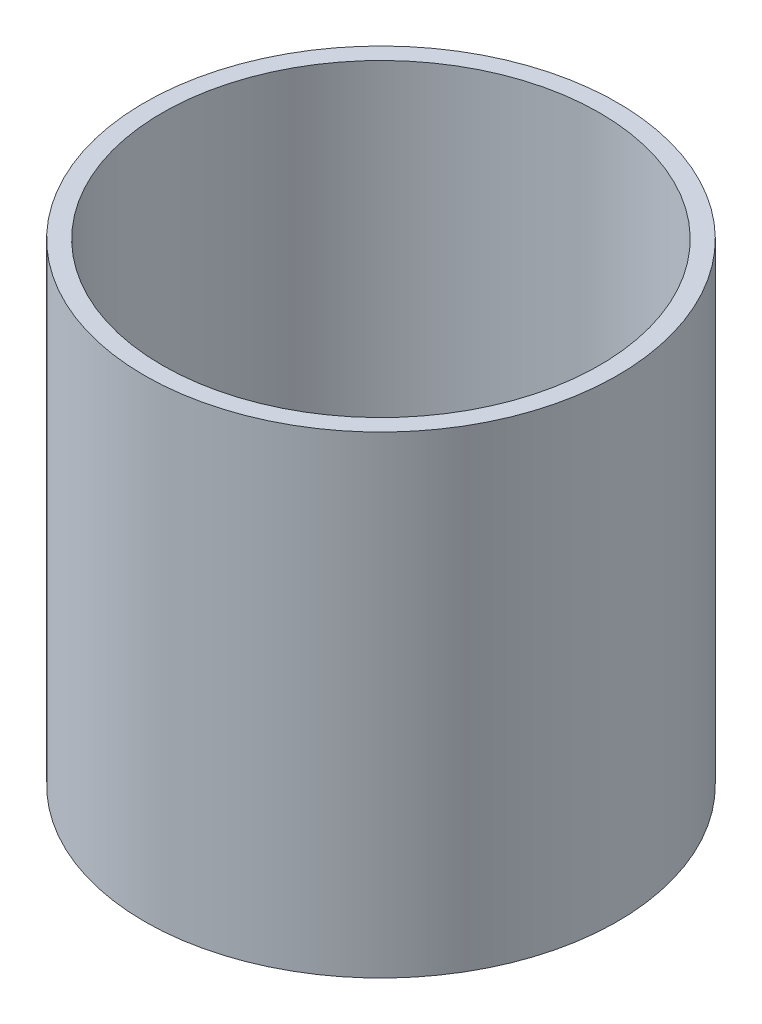
ISO-10303-21;
HEADER;
FILE_DESCRIPTION(('STEP AP214'),'2;1');
FILE_NAME('part.step','',(''),(''),'','','');
FILE_SCHEMA(('AUTOMOTIVE_DESIGN { 1 0 10303 214 1 1 1 1 }'));
ENDSEC;
DATA;
#1=APPLICATION_CONTEXT('core data for automotive mechanical design processes');
#2=APPLICATION_PROTOCOL_DEFINITION('international standard','automotive_design',2000,#1);
#3=PRODUCT_CONTEXT('',#1,'mechanical');
#4=PRODUCT('Part','Part','',(#3));
#5=PRODUCT_RELATED_PRODUCT_CATEGORY('part','',(#4));
#6=PRODUCT_DEFINITION_FORMATION('','',#4);
#7=PRODUCT_DEFINITION_CONTEXT('part definition',#1,'design');
#8=PRODUCT_DEFINITION('design','',#6,#7);
#9=PRODUCT_DEFINITION_SHAPE('','',#8);
#10=(LENGTH_UNIT() NAMED_UNIT(*) SI_UNIT(.MILLI.,.METRE.));
#11=(NAMED_UNIT(*) PLANE_ANGLE_UNIT() SI_UNIT($,.RADIAN.));
#12=(NAMED_UNIT(*) SI_UNIT($,.STERADIAN.) SOLID_ANGLE_UNIT());
#13=UNCERTAINTY_MEASURE_WITH_UNIT(LENGTH_MEASURE(1.E-05),#10,'distance_accuracy_value','');
#14=(GEOMETRIC_REPRESENTATION_CONTEXT(3) GLOBAL_UNCERTAINTY_ASSIGNED_CONTEXT((#13)) GLOBAL_UNIT_ASSIGNED_CONTEXT((#10,
#11,#12)) REPRESENTATION_CONTEXT('',''));
#15=CARTESIAN_POINT('',(0.,0.,0.));
#16=DIRECTION('',(0.,0.,1.));
#17=DIRECTION('',(1.,0.,0.));
#18=AXIS2_PLACEMENT_3D('',#15,#16,#17);
#19=CARTESIAN_POINT('',(0.,5.,0.));
#20=DIRECTION('',(0.,-1.,0.));
#21=DIRECTION('',(0.,0.,-1.));
#22=AXIS2_PLACEMENT_3D('',#19,#20,#21);
#23=CYLINDRICAL_SURFACE('',#22,40.);
#24=CARTESIAN_POINT('',(0.,0.,0.));
#25=DIRECTION('',(0.,1.,0.));
#26=DIRECTION('',(0.,0.,1.));
#27=AXIS2_PLACEMENT_3D('',#24,#25,#26);
#28=CIRCLE('',#27,40.);
#29=CARTESIAN_POINT('',(0.,0.,40.));
#30=VERTEX_POINT('',#29);
#31=EDGE_CURVE('E36',#30,#30,#28,.T.);
#32=ORIENTED_EDGE('',*,*,#31,.T.);
#33=EDGE_LOOP('',(#32));
#34=FACE_BOUND('',#33,.T.);
#35=CARTESIAN_POINT('',(0.,80.,0.));
#36=DIRECTION('',(0.,1.,0.));
#37=DIRECTION('',(0.,0.,1.));
#38=AXIS2_PLACEMENT_3D('',#35,#36,#37);
#39=CIRCLE('',#38,40.);
#40=CARTESIAN_POINT('',(0.,80.,40.));
#41=VERTEX_POINT('',#40);
#42=EDGE_CURVE('E40',#41,#41,#39,.T.);
#43=ORIENTED_EDGE('',*,*,#42,.F.);
#44=EDGE_LOOP('',(#43));
#45=FACE_BOUND('',#44,.T.);
#46=ADVANCED_FACE('F30',(#34,#45),#23,.T.);
#47=CARTESIAN_POINT('',(0.,0.,0.));
#48=DIRECTION('',(0.,1.,0.));
#49=DIRECTION('',(0.,0.,1.));
#50=AXIS2_PLACEMENT_3D('',#47,#48,#49);
#51=PLANE('',#50);
#52=ORIENTED_EDGE('',*,*,#31,.F.);
#53=EDGE_LOOP('',(#52));
#54=FACE_BOUND('',#53,.T.);
#55=ADVANCED_FACE('F54',(#54),#51,.F.);
#56=CARTESIAN_POINT('',(0.,80.,0.));
#57=DIRECTION('',(0.,1.,0.));
#58=DIRECTION('',(0.,0.,1.));
#59=AXIS2_PLACEMENT_3D('',#56,#57,#58);
#60=PLANE('',#59);
#61=ORIENTED_EDGE('',*,*,#42,.T.);
#62=EDGE_LOOP('',(#61));
#63=FACE_BOUND('',#62,.T.);
#64=CARTESIAN_POINT('',(0.,80.,0.));
#65=DIRECTION('',(0.,1.,0.));
#66=DIRECTION('',(0.,0.,1.));
#67=AXIS2_PLACEMENT_3D('',#64,#65,#66);
#68=CIRCLE('',#67,37.);
#69=CARTESIAN_POINT('',(0.,80.,37.));
#70=VERTEX_POINT('',#69);
#71=EDGE_CURVE('E44',#70,#70,#68,.T.);
#72=ORIENTED_EDGE('',*,*,#71,.F.);
#73=EDGE_LOOP('',(#72));
#74=FACE_BOUND('',#73,.T.);
#75=ADVANCED_FACE('F52',(#63,#74),#60,.T.);
#76=CARTESIAN_POINT('',(0.,80.,0.));
#77=DIRECTION('',(0.,-1.,0.));
#78=DIRECTION('',(0.,0.,-1.));
#79=AXIS2_PLACEMENT_3D('',#76,#77,#78);
#80=CYLINDRICAL_SURFACE('',#79,37.);
#81=ORIENTED_EDGE('',*,*,#71,.T.);
#82=EDGE_LOOP('',(#81));
#83=FACE_BOUND('',#82,.T.);
#84=CARTESIAN_POINT('',(0.,5.,0.));
#85=DIRECTION('',(0.,1.,0.));
#86=DIRECTION('',(0.,0.,1.));
#87=AXIS2_PLACEMENT_3D('',#84,#85,#86);
#88=CIRCLE('',#87,37.);
#89=CARTESIAN_POINT('',(0.,5.,37.));
#90=VERTEX_POINT('',#89);
#91=EDGE_CURVE('E10',#90,#90,#88,.F.);
#92=ORIENTED_EDGE('',*,*,#91,.T.);
#93=EDGE_LOOP('',(#92));
#94=FACE_BOUND('',#93,.T.);
#95=ADVANCED_FACE('F50',(#83,#94),#80,.F.);
#96=CARTESIAN_POINT('',(0.,5.,0.));
#97=DIRECTION('',(0.,1.,0.));
#98=DIRECTION('',(0.,0.,1.));
#99=AXIS2_PLACEMENT_3D('',#96,#97,#98);
#100=PLANE('',#99);
#101=ORIENTED_EDGE('',*,*,#91,.F.);
#102=EDGE_LOOP('',(#101));
#103=FACE_BOUND('',#102,.T.);
#104=ADVANCED_FACE('F61',(#103),#100,.T.);
#105=CLOSED_SHELL('',(#46,#55,#75,#95,#104));
#106=MANIFOLD_SOLID_BREP('B2',#105);
#107=ADVANCED_BREP_SHAPE_REPRESENTATION('',(#18,#106),#14);
#108=SHAPE_DEFINITION_REPRESENTATION(#9,#107);
ENDSEC;
END-ISO-10303-21;
